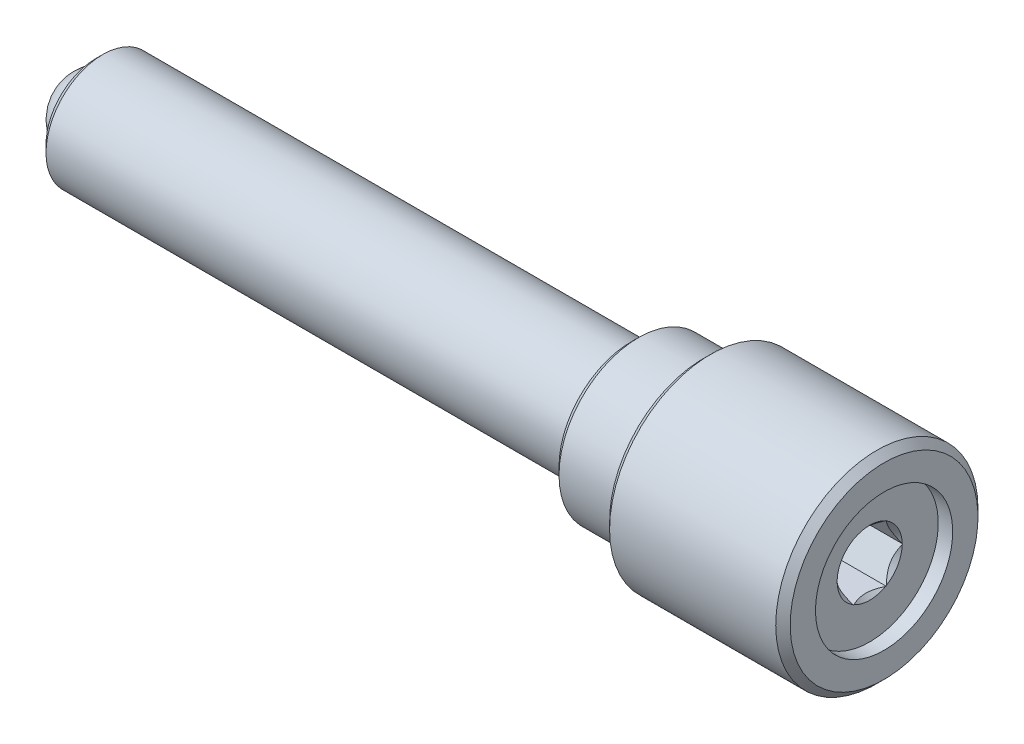
ISO-10303-21;
HEADER;
FILE_DESCRIPTION(('STEP AP214'),'2;1');
FILE_NAME('part.step','',(''),(''),'','','');
FILE_SCHEMA(('AUTOMOTIVE_DESIGN { 1 0 10303 214 1 1 1 1 }'));
ENDSEC;
DATA;
#1=APPLICATION_CONTEXT('core data for automotive mechanical design processes');
#2=APPLICATION_PROTOCOL_DEFINITION('international standard','automotive_design',2000,#1);
#3=PRODUCT_CONTEXT('',#1,'mechanical');
#4=PRODUCT('Part','Part','',(#3));
#5=PRODUCT_RELATED_PRODUCT_CATEGORY('part','',(#4));
#6=PRODUCT_DEFINITION_FORMATION('','',#4);
#7=PRODUCT_DEFINITION_CONTEXT('part definition',#1,'design');
#8=PRODUCT_DEFINITION('design','',#6,#7);
#9=PRODUCT_DEFINITION_SHAPE('','',#8);
#10=(LENGTH_UNIT() NAMED_UNIT(*) SI_UNIT(.MILLI.,.METRE.));
#11=(NAMED_UNIT(*) PLANE_ANGLE_UNIT() SI_UNIT($,.RADIAN.));
#12=(NAMED_UNIT(*) SI_UNIT($,.STERADIAN.) SOLID_ANGLE_UNIT());
#13=UNCERTAINTY_MEASURE_WITH_UNIT(LENGTH_MEASURE(1.E-05),#10,'distance_accuracy_value','');
#14=(GEOMETRIC_REPRESENTATION_CONTEXT(3) GLOBAL_UNCERTAINTY_ASSIGNED_CONTEXT((#13)) GLOBAL_UNIT_ASSIGNED_CONTEXT((#10,
#11,#12)) REPRESENTATION_CONTEXT('',''));
#15=CARTESIAN_POINT('',(0.,0.,0.));
#16=DIRECTION('',(0.,0.,1.));
#17=DIRECTION('',(1.,0.,0.));
#18=AXIS2_PLACEMENT_3D('',#15,#16,#17);
#19=CARTESIAN_POINT('',(-28.6188490285806,-2.28638954609726,11.5802550047874));
#20=DIRECTION('',(1.,0.,0.));
#21=DIRECTION('',(0.,1.,0.));
#22=AXIS2_PLACEMENT_3D('',#19,#20,#21);
#23=PLANE('',#22);
#24=CARTESIAN_POINT('',(-28.6188490285806,-3.68338954609726,11.5802550047874));
#25=DIRECTION('',(1.,0.,0.));
#26=DIRECTION('',(0.,1.,0.));
#27=AXIS2_PLACEMENT_3D('',#24,#25,#26);
#28=CIRCLE('',#27,1.746);
#29=CARTESIAN_POINT('',(-28.6188490285806,-1.93738954609726,11.5802550047874));
#30=VERTEX_POINT('',#29);
#31=EDGE_CURVE('P0_E11',#30,#30,#28,.F.);
#32=ORIENTED_EDGE('',*,*,#31,.T.);
#33=EDGE_LOOP('',(#32));
#34=FACE_BOUND('',#33,.T.);
#35=CARTESIAN_POINT('',(-28.6188490285806,-3.68338954609726,11.5802550047874));
#36=DIRECTION('',(-1.,0.,0.));
#37=DIRECTION('',(0.,-1.,0.));
#38=AXIS2_PLACEMENT_3D('',#35,#36,#37);
#39=CIRCLE('',#38,1.397);
#40=CARTESIAN_POINT('',(-28.6188490285806,-5.08038954609726,11.5802550047874));
#41=VERTEX_POINT('',#40);
#42=EDGE_CURVE('P0_E36',#41,#41,#39,.T.);
#43=ORIENTED_EDGE('',*,*,#42,.F.);
#44=EDGE_LOOP('',(#43));
#45=FACE_BOUND('',#44,.T.);
#46=ADVANCED_FACE('P0_F16',(#34,#45),#23,.F.);
#47=CARTESIAN_POINT('',(-26.4337555020967,-3.68338954609726,11.5802550047874));
#48=DIRECTION('',(-1.,0.,0.));
#49=DIRECTION('',(0.,-1.,0.));
#50=AXIS2_PLACEMENT_3D('',#47,#48,#49);
#51=CYLINDRICAL_SURFACE('',#50,1.397);
#52=CARTESIAN_POINT('',(-27.8307555020967,-3.68338954609726,11.5802550047874));
#53=DIRECTION('',(-1.,0.,0.));
#54=DIRECTION('',(0.,-1.,0.));
#55=AXIS2_PLACEMENT_3D('',#52,#53,#54);
#56=CIRCLE('',#55,1.397);
#57=CARTESIAN_POINT('',(-27.8307555020967,-5.08038954609726,11.5802550047874));
#58=VERTEX_POINT('',#57);
#59=EDGE_CURVE('P0_E34',#58,#58,#56,.T.);
#60=ORIENTED_EDGE('',*,*,#59,.F.);
#61=EDGE_LOOP('',(#60));
#62=FACE_BOUND('',#61,.T.);
#63=ORIENTED_EDGE('',*,*,#42,.T.);
#64=EDGE_LOOP('',(#63));
#65=FACE_BOUND('',#64,.T.);
#66=ADVANCED_FACE('P0_F30',(#62,#65),#51,.F.);
#67=CARTESIAN_POINT('',(-27.8307555020967,-3.68338954609726,11.5802550047874));
#68=DIRECTION('',(-1.,0.,0.));
#69=DIRECTION('',(0.,-1.,0.));
#70=AXIS2_PLACEMENT_3D('',#67,#68,#69);
#71=CONICAL_SURFACE('',#70,1.397,0.785398163397451);
#72=CARTESIAN_POINT('',(-26.4337555020967,-3.68338954609726,11.5802550047874));
#73=VERTEX_POINT('',#72);
#74=VERTEX_LOOP('',#73);
#75=FACE_BOUND('',#74,.T.);
#76=ORIENTED_EDGE('',*,*,#59,.T.);
#77=EDGE_LOOP('',(#76));
#78=FACE_BOUND('',#77,.T.);
#79=ADVANCED_FACE('P0_F26',(#75,#78),#71,.F.);
#80=CARTESIAN_POINT('',(-5.78724902858061,-3.68338954609726,11.5802550047874));
#81=DIRECTION('',(-1.,0.,0.));
#82=DIRECTION('',(0.,-1.,0.));
#83=AXIS2_PLACEMENT_3D('',#80,#81,#82);
#84=PLANE('',#83);
#85=CARTESIAN_POINT('',(-5.78724902858061,-3.68338954609726,11.5802550047874));
#86=DIRECTION('',(-1.,0.,0.));
#87=DIRECTION('',(0.,-1.,0.));
#88=AXIS2_PLACEMENT_3D('',#85,#86,#87);
#89=CIRCLE('',#88,1.74599999999999);
#90=CARTESIAN_POINT('',(-5.78724902858061,-5.42938954609725,11.5802550047874));
#91=VERTEX_POINT('',#90);
#92=EDGE_CURVE('P0_E23',#91,#91,#89,.F.);
#93=ORIENTED_EDGE('',*,*,#92,.T.);
#94=EDGE_LOOP('',(#93));
#95=FACE_BOUND('',#94,.T.);
#96=ADVANCED_FACE('P0_F29',(#95),#84,.F.);
#97=CARTESIAN_POINT('',(-26.4337555020967,-3.68338954609726,11.5802550047874));
#98=DIRECTION('',(-1.,0.,0.));
#99=DIRECTION('',(0.,-1.,0.));
#100=AXIS2_PLACEMENT_3D('',#97,#98,#99);
#101=CYLINDRICAL_SURFACE('',#100,2.);
#102=CARTESIAN_POINT('',(-6.04124902858061,-3.68338954609726,11.5802550047874));
#103=DIRECTION('',(-1.,0.,0.));
#104=DIRECTION('',(0.,0.,1.));
#105=AXIS2_PLACEMENT_3D('',#102,#103,#104);
#106=CIRCLE('',#105,2.);
#107=CARTESIAN_POINT('',(-6.04124902858061,-3.68338954609726,13.5802550047874));
#108=VERTEX_POINT('',#107);
#109=EDGE_CURVE('P0_E44',#108,#108,#106,.T.);
#110=ORIENTED_EDGE('',*,*,#109,.T.);
#111=EDGE_LOOP('',(#110));
#112=FACE_BOUND('',#111,.T.);
#113=CARTESIAN_POINT('',(-28.3648490285806,-3.68338954609726,11.5802550047874));
#114=DIRECTION('',(1.,0.,0.));
#115=DIRECTION('',(0.,1.,0.));
#116=AXIS2_PLACEMENT_3D('',#113,#114,#115);
#117=CIRCLE('',#116,2.);
#118=CARTESIAN_POINT('',(-28.3648490285806,-1.68338954609726,11.5802550047874));
#119=VERTEX_POINT('',#118);
#120=EDGE_CURVE('P0_E39',#119,#119,#117,.T.);
#121=ORIENTED_EDGE('',*,*,#120,.T.);
#122=EDGE_LOOP('',(#121));
#123=FACE_BOUND('',#122,.T.);
#124=ADVANCED_FACE('P0_F53',(#112,#123),#101,.T.);
#125=CARTESIAN_POINT('',(-6.04124902858061,-3.68338954609726,11.5802550047874));
#126=DIRECTION('',(-1.,0.,0.));
#127=DIRECTION('',(0.,0.,1.));
#128=AXIS2_PLACEMENT_3D('',#125,#126,#127);
#129=CONICAL_SURFACE('',#128,2.,0.785398163397453);
#130=ORIENTED_EDGE('',*,*,#92,.F.);
#131=EDGE_LOOP('',(#130));
#132=FACE_BOUND('',#131,.T.);
#133=ORIENTED_EDGE('',*,*,#109,.F.);
#134=EDGE_LOOP('',(#133));
#135=FACE_BOUND('',#134,.T.);
#136=ADVANCED_FACE('P0_F50',(#132,#135),#129,.T.);
#137=CARTESIAN_POINT('',(-28.6188490285806,-3.68338954609726,11.5802550047874));
#138=DIRECTION('',(1.,0.,0.));
#139=DIRECTION('',(0.,1.,0.));
#140=AXIS2_PLACEMENT_3D('',#137,#138,#139);
#141=CONICAL_SURFACE('',#140,1.746,0.785398163397443);
#142=ORIENTED_EDGE('',*,*,#120,.F.);
#143=EDGE_LOOP('',(#142));
#144=FACE_BOUND('',#143,.T.);
#145=ORIENTED_EDGE('',*,*,#31,.F.);
#146=EDGE_LOOP('',(#145));
#147=FACE_BOUND('',#146,.T.);
#148=ADVANCED_FACE('P0_F18',(#144,#147),#141,.T.);
#149=CLOSED_SHELL('',(#46,#66,#79,#96,#124,#136,#148));
#150=MANIFOLD_SOLID_BREP('P0_B1',#149);
#151=CARTESIAN_POINT('',(-28.3981865285806,-3.68338954609726,11.5802550047874));
#152=DIRECTION('',(0.,1.,0.));
#153=DIRECTION('',(-1.,0.,0.));
#154=AXIS2_PLACEMENT_3D('',#151,#152,#153);
#155=SPHERICAL_SURFACE('',#154,1.3890625);
#156=CARTESIAN_POINT('',(-28.3981865285806,-3.68338954609726,11.5802550047874));
#157=DIRECTION('',(0.,-1.,0.));
#158=DIRECTION('',(0.,0.,-1.));
#159=AXIS2_PLACEMENT_3D('',#156,#157,#158);
#160=CIRCLE('',#159,1.3890625);
#161=CARTESIAN_POINT('',(-29.7872490285806,-3.68338954609726,11.5802550047874));
#162=VERTEX_POINT('',#161);
#163=CARTESIAN_POINT('',(-27.0091240285806,-3.68338954609726,11.5802550047874));
#164=VERTEX_POINT('',#163);
#165=EDGE_CURVE('P1_E38',#162,#164,#160,.T.);
#166=ORIENTED_EDGE('',*,*,#165,.T.);
#167=CARTESIAN_POINT('',(-28.3981865285806,-3.68338954609726,11.5802550047874));
#168=DIRECTION('',(0.,0.,-1.));
#169=DIRECTION('',(-1.,0.,0.));
#170=AXIS2_PLACEMENT_3D('',#167,#168,#169);
#171=CIRCLE('',#170,1.3890625);
#172=EDGE_CURVE('P1_E11',#164,#162,#171,.T.);
#173=ORIENTED_EDGE('',*,*,#172,.T.);
#174=EDGE_LOOP('',(#166,#173));
#175=FACE_BOUND('',#174,.T.);
#176=ADVANCED_FACE('P1_F16',(#175),#155,.T.);
#177=ORIENTED_EDGE('',*,*,#165,.F.);
#178=CARTESIAN_POINT('',(-28.3981865285806,-3.68338954609726,11.5802550047874));
#179=DIRECTION('',(0.,0.,-1.));
#180=DIRECTION('',(-1.,0.,0.));
#181=AXIS2_PLACEMENT_3D('',#178,#179,#180);
#182=CIRCLE('',#181,1.3890625);
#183=EDGE_CURVE('P1_E23',#162,#164,#182,.T.);
#184=ORIENTED_EDGE('',*,*,#183,.T.);
#185=EDGE_LOOP('',(#177,#184));
#186=FACE_BOUND('',#185,.T.);
#187=ADVANCED_FACE('P1_F37',(#186),#155,.T.);
#188=ORIENTED_EDGE('',*,*,#172,.F.);
#189=EDGE_CURVE('P1_E34',#164,#162,#160,.T.);
#190=ORIENTED_EDGE('',*,*,#189,.T.);
#191=EDGE_LOOP('',(#188,#190));
#192=FACE_BOUND('',#191,.T.);
#193=ADVANCED_FACE('P1_F32',(#192),#155,.T.);
#194=ORIENTED_EDGE('',*,*,#183,.F.);
#195=ORIENTED_EDGE('',*,*,#189,.F.);
#196=EDGE_LOOP('',(#194,#195));
#197=FACE_BOUND('',#196,.T.);
#198=ADVANCED_FACE('P1_F18',(#197),#155,.T.);
#199=CLOSED_SHELL('',(#176,#187,#193,#198));
#200=MANIFOLD_SOLID_BREP('P1_B1',#199);
#201=CARTESIAN_POINT('',(-7.2472490285806,-3.68338954609726,11.5802550047874));
#202=DIRECTION('',(-1.,0.,0.));
#203=DIRECTION('',(0.,0.865967665550997,0.500099992221712));
#204=AXIS2_PLACEMENT_3D('',#201,#202,#203);
#205=CYLINDRICAL_SURFACE('',#204,2.794);
#206=CARTESIAN_POINT('',(-9.5332490285806,-3.68338954609726,11.5802550047874));
#207=DIRECTION('',(1.,0.,0.));
#208=DIRECTION('',(0.,-0.865967665550997,-0.500099992221712));
#209=AXIS2_PLACEMENT_3D('',#206,#207,#208);
#210=CIRCLE('',#209,2.794);
#211=CARTESIAN_POINT('',(-9.5332490285806,-6.10290320364675,10.18297562652));
#212=VERTEX_POINT('',#211);
#213=EDGE_CURVE('P2_E29',#212,#212,#210,.T.);
#214=ORIENTED_EDGE('',*,*,#213,.T.);
#215=EDGE_LOOP('',(#214));
#216=FACE_BOUND('',#215,.T.);
#217=CARTESIAN_POINT('',(-7.2472490285806,-3.68338954609726,11.5802550047874));
#218=DIRECTION('',(1.,0.,0.));
#219=DIRECTION('',(0.,-0.865967665550997,-0.500099992221712));
#220=AXIS2_PLACEMENT_3D('',#217,#218,#219);
#221=CIRCLE('',#220,2.794);
#222=CARTESIAN_POINT('',(-7.2472490285806,-6.10290320364675,10.18297562652));
#223=VERTEX_POINT('',#222);
#224=EDGE_CURVE('P2_E168',#223,#223,#221,.T.);
#225=ORIENTED_EDGE('',*,*,#224,.F.);
#226=EDGE_LOOP('',(#225));
#227=FACE_BOUND('',#226,.T.);
#228=ADVANCED_FACE('P2_F15',(#216,#227),#205,.T.);
#229=CARTESIAN_POINT('',(-9.7872490285806,-3.68338954609726,11.5802550047874));
#230=DIRECTION('',(1.,0.,0.));
#231=DIRECTION('',(0.,-0.865967665550997,-0.500099992221712));
#232=AXIS2_PLACEMENT_3D('',#229,#230,#231);
#233=PLANE('',#232);
#234=CARTESIAN_POINT('',(-9.7872490285806,-3.68338954609726,11.5802550047874));
#235=DIRECTION('',(1.,0.,0.));
#236=DIRECTION('',(0.,-0.865967665550997,-0.500099992221712));
#237=AXIS2_PLACEMENT_3D('',#234,#235,#236);
#238=CIRCLE('',#237,2.2479);
#239=CARTESIAN_POINT('',(-9.7872490285806,-5.62999826148935,10.4560802322722));
#240=VERTEX_POINT('',#239);
#241=EDGE_CURVE('P2_E191',#240,#240,#238,.T.);
#242=ORIENTED_EDGE('',*,*,#241,.T.);
#243=EDGE_LOOP('',(#242));
#244=FACE_BOUND('',#243,.T.);
#245=CARTESIAN_POINT('',(-9.7872490285806,-3.68338954609726,11.5802550047874));
#246=DIRECTION('',(1.,0.,0.));
#247=DIRECTION('',(0.,-0.865967665550997,-0.500099992221712));
#248=AXIS2_PLACEMENT_3D('',#245,#246,#247);
#249=CIRCLE('',#248,2.54);
#250=CARTESIAN_POINT('',(-9.7872490285806,-5.8829474165968,10.3100010245443));
#251=VERTEX_POINT('',#250);
#252=EDGE_CURVE('P2_E188',#251,#251,#249,.F.);
#253=ORIENTED_EDGE('',*,*,#252,.T.);
#254=EDGE_LOOP('',(#253));
#255=FACE_BOUND('',#254,.T.);
#256=ADVANCED_FACE('P2_F214',(#244,#255),#233,.F.);
#257=CARTESIAN_POINT('',(-7.2472490285806,-3.68338954609726,11.5802550047874));
#258=DIRECTION('',(1.,0.,0.));
#259=DIRECTION('',(0.,-0.865967665550997,-0.500099992221712));
#260=AXIS2_PLACEMENT_3D('',#257,#258,#259);
#261=PLANE('',#260);
#262=CARTESIAN_POINT('',(-7.2472490285806,-3.68338954609726,11.5802550047874));
#263=DIRECTION('',(1.,0.,0.));
#264=DIRECTION('',(0.,-0.865967665550997,-0.500099992221712));
#265=AXIS2_PLACEMENT_3D('',#262,#263,#264);
#266=CIRCLE('',#265,3.302);
#267=CARTESIAN_POINT('',(-7.2472490285806,-6.54281477774666,9.92892483047133));
#268=VERTEX_POINT('',#267);
#269=EDGE_CURVE('P2_E182',#268,#268,#266,.F.);
#270=ORIENTED_EDGE('',*,*,#269,.T.);
#271=EDGE_LOOP('',(#270));
#272=FACE_BOUND('',#271,.T.);
#273=ORIENTED_EDGE('',*,*,#224,.T.);
#274=EDGE_LOOP('',(#273));
#275=FACE_BOUND('',#274,.T.);
#276=ADVANCED_FACE('P2_F219',(#272,#275),#261,.F.);
#277=CARTESIAN_POINT('',(-0.897249028580602,-3.68338954609726,11.5802550047874));
#278=DIRECTION('',(-1.,0.,0.));
#279=DIRECTION('',(0.,0.865967665550997,0.500099992221712));
#280=AXIS2_PLACEMENT_3D('',#277,#278,#279);
#281=CYLINDRICAL_SURFACE('',#280,3.556);
#282=CARTESIAN_POINT('',(-1.1512490285806,-3.68338954609726,11.5802550047874));
#283=DIRECTION('',(1.,0.,0.));
#284=DIRECTION('',(0.,-0.865967665550997,-0.500099992221712));
#285=AXIS2_PLACEMENT_3D('',#282,#283,#284);
#286=CIRCLE('',#285,3.556);
#287=CARTESIAN_POINT('',(-1.1512490285806,-6.76277056479661,9.80189943244702));
#288=VERTEX_POINT('',#287);
#289=EDGE_CURVE('P2_E179',#288,#288,#286,.F.);
#290=ORIENTED_EDGE('',*,*,#289,.T.);
#291=EDGE_LOOP('',(#290));
#292=FACE_BOUND('',#291,.T.);
#293=CARTESIAN_POINT('',(-6.99324902858061,-3.68338954609726,11.5802550047874));
#294=DIRECTION('',(1.,0.,0.));
#295=DIRECTION('',(0.,-0.865967665550997,-0.500099992221712));
#296=AXIS2_PLACEMENT_3D('',#293,#294,#295);
#297=CIRCLE('',#296,3.556);
#298=CARTESIAN_POINT('',(-6.99324902858061,-6.76277056479661,9.80189943244702));
#299=VERTEX_POINT('',#298);
#300=EDGE_CURVE('P2_E176',#299,#299,#297,.T.);
#301=ORIENTED_EDGE('',*,*,#300,.T.);
#302=EDGE_LOOP('',(#301));
#303=FACE_BOUND('',#302,.T.);
#304=ADVANCED_FACE('P2_F237',(#292,#303),#281,.T.);
#305=CARTESIAN_POINT('',(-0.897249028580602,-3.68338954609726,11.5802550047874));
#306=DIRECTION('',(1.,0.,0.));
#307=DIRECTION('',(0.,-0.865967665550997,-0.500099992221712));
#308=AXIS2_PLACEMENT_3D('',#305,#306,#307);
#309=PLANE('',#308);
#310=CARTESIAN_POINT('',(-0.897249028580602,-3.68338954609726,11.5802550047874));
#311=DIRECTION('',(1.,0.,0.));
#312=DIRECTION('',(0.,-0.865967665550997,-0.500099992221712));
#313=AXIS2_PLACEMENT_3D('',#310,#311,#312);
#314=CIRCLE('',#313,3.302);
#315=CARTESIAN_POINT('',(-0.897249028580602,-6.54281477774665,9.92892483047133));
#316=VERTEX_POINT('',#315);
#317=EDGE_CURVE('P2_E173',#316,#316,#314,.T.);
#318=ORIENTED_EDGE('',*,*,#317,.T.);
#319=EDGE_LOOP('',(#318));
#320=FACE_BOUND('',#319,.T.);
#321=CARTESIAN_POINT('',(-0.897249028580602,-3.68338954609726,11.5802550047874));
#322=DIRECTION('',(1.,0.,0.));
#323=DIRECTION('',(0.,-0.865967665550997,-0.500099992221712));
#324=AXIS2_PLACEMENT_3D('',#321,#322,#323);
#325=CIRCLE('',#324,2.413);
#326=CARTESIAN_POINT('',(-0.897249028580602,-5.77296952307182,10.3735137235564));
#327=VERTEX_POINT('',#326);
#328=EDGE_CURVE('P2_E164',#327,#327,#325,.T.);
#329=ORIENTED_EDGE('',*,*,#328,.F.);
#330=EDGE_LOOP('',(#329));
#331=FACE_BOUND('',#330,.T.);
#332=ADVANCED_FACE('P2_F239',(#320,#331),#309,.T.);
#333=CARTESIAN_POINT('',(-1.4052490285806,-3.68338954609726,11.5802550047874));
#334=DIRECTION('',(1.,0.,0.));
#335=DIRECTION('',(0.,-0.865967665550997,-0.500099992221712));
#336=AXIS2_PLACEMENT_3D('',#333,#334,#335);
#337=CYLINDRICAL_SURFACE('',#336,2.413);
#338=CARTESIAN_POINT('',(-1.4052490285806,-3.68338954609726,11.5802550047874));
#339=DIRECTION('',(1.,0.,0.));
#340=DIRECTION('',(0.,-0.865967665550997,-0.500099992221712));
#341=AXIS2_PLACEMENT_3D('',#338,#339,#340);
#342=CIRCLE('',#341,2.413);
#343=CARTESIAN_POINT('',(-1.4052490285806,-5.77296952307182,10.3735137235564));
#344=VERTEX_POINT('',#343);
#345=EDGE_CURVE('P2_E165',#344,#344,#342,.T.);
#346=ORIENTED_EDGE('',*,*,#345,.F.);
#347=EDGE_LOOP('',(#346));
#348=FACE_BOUND('',#347,.T.);
#349=ORIENTED_EDGE('',*,*,#328,.T.);
#350=EDGE_LOOP('',(#349));
#351=FACE_BOUND('',#350,.T.);
#352=ADVANCED_FACE('P2_F245',(#348,#351),#337,.F.);
#353=CARTESIAN_POINT('',(-1.4052490285806,-3.68338954609726,11.5802550047874));
#354=DIRECTION('',(1.,0.,0.));
#355=DIRECTION('',(0.,-0.865967665550997,-0.500099992221712));
#356=AXIS2_PLACEMENT_3D('',#353,#354,#355);
#357=PLANE('',#356);
#358=CARTESIAN_POINT('',(-1.4052490285806,-3.68338954609726,11.5802550047874));
#359=DIRECTION('',(1.,0.,0.));
#360=DIRECTION('',(0.,-0.865967665550997,-0.500099992221712));
#361=AXIS2_PLACEMENT_3D('',#358,#359,#360);
#362=CIRCLE('',#361,1.143);
#363=CARTESIAN_POINT('',(-1.4052490285806,-4.66273442568325,10.9909056967971));
#364=VERTEX_POINT('',#363);
#365=CARTESIAN_POINT('',(-1.4052490285806,-3.70384466873571,10.437438051834));
#366=VERTEX_POINT('',#365);
#367=EDGE_CURVE('P2_E112',#364,#366,#362,.T.);
#368=ORIENTED_EDGE('',*,*,#367,.F.);
#369=DIRECTION('',(0.,0.866083130471901,-0.499900001112214));
#370=VECTOR('',#369,1.);
#371=CARTESIAN_POINT('',(-1.4052490285806,-4.68332287572803,11.0027892745256));
#372=LINE('',#371,#370);
#373=CARTESIAN_POINT('',(-1.4052490285806,-4.68332287572803,11.0027892745256));
#374=VERTEX_POINT('',#373);
#375=EDGE_CURVE('P2_E124',#374,#364,#372,.T.);
#376=ORIENTED_EDGE('',*,*,#375,.F.);
#377=DIRECTION('',(0.,0.000115464920903918,-0.999999993333926));
#378=VECTOR('',#377,1.);
#379=CARTESIAN_POINT('',(-1.4052490285806,-4.68345620313436,12.1574898052075));
#380=LINE('',#379,#378);
#381=CARTESIAN_POINT('',(-1.4052490285806,-4.68332562054971,11.0265611841531));
#382=VERTEX_POINT('',#381);
#383=EDGE_CURVE('P2_E332',#382,#374,#380,.T.);
#384=ORIENTED_EDGE('',*,*,#383,.F.);
#385=CARTESIAN_POINT('',(-1.4052490285806,-4.68345345831268,12.1337178955799));
#386=VERTEX_POINT('',#385);
#387=EDGE_CURVE('P2_E129',#386,#382,#362,.T.);
#388=ORIENTED_EDGE('',*,*,#387,.F.);
#389=CARTESIAN_POINT('',(-1.4052490285806,-4.68345620313436,12.1574898052075));
#390=VERTEX_POINT('',#389);
#391=EDGE_CURVE('P2_E138',#390,#386,#380,.T.);
#392=ORIENTED_EDGE('',*,*,#391,.F.);
#393=DIRECTION('',(0.,-0.865967665550997,-0.500099992221712));
#394=VECTOR('',#393,1.);
#395=CARTESIAN_POINT('',(-1.4052490285806,-3.68352287350359,12.7349555354694));
#396=LINE('',#395,#394);
#397=CARTESIAN_POINT('',(-1.4052490285806,-4.66287049791127,12.1693781371066));
#398=VERTEX_POINT('',#397);
#399=EDGE_CURVE('P2_E333',#398,#390,#396,.T.);
#400=ORIENTED_EDGE('',*,*,#399,.F.);
#401=CARTESIAN_POINT('',(-1.4052490285806,-3.70410857872669,12.7230672035703));
#402=VERTEX_POINT('',#401);
#403=EDGE_CURVE('P2_E369',#402,#398,#362,.T.);
#404=ORIENTED_EDGE('',*,*,#403,.F.);
#405=CARTESIAN_POINT('',(-1.4052490285806,-3.68352287350359,12.7349555354694));
#406=VERTEX_POINT('',#405);
#407=EDGE_CURVE('P2_E327',#406,#402,#396,.T.);
#408=ORIENTED_EDGE('',*,*,#407,.F.);
#409=DIRECTION('',(0.,-0.866083130471901,0.499900001112214));
#410=VECTOR('',#409,1.);
#411=CARTESIAN_POINT('',(-1.4052490285806,-2.68345621646649,12.1577207350493));
#412=LINE('',#411,#410);
#413=CARTESIAN_POINT('',(-1.4052490285806,-3.66293442345881,12.7230719577409));
#414=VERTEX_POINT('',#413);
#415=EDGE_CURVE('P2_E338',#414,#406,#412,.T.);
#416=ORIENTED_EDGE('',*,*,#415,.F.);
#417=CARTESIAN_POINT('',(-1.4052490285806,-2.70404466651127,12.1696043127778));
#418=VERTEX_POINT('',#417);
#419=EDGE_CURVE('P2_E368',#418,#414,#362,.T.);
#420=ORIENTED_EDGE('',*,*,#419,.F.);
#421=CARTESIAN_POINT('',(-1.4052490285806,-2.68345621646649,12.1577207350493));
#422=VERTEX_POINT('',#421);
#423=EDGE_CURVE('P2_E334',#422,#418,#412,.T.);
#424=ORIENTED_EDGE('',*,*,#423,.F.);
#425=DIRECTION('',(0.,-0.000115464920903863,0.999999993333926));
#426=VECTOR('',#425,1.);
#427=CARTESIAN_POINT('',(-1.4052490285806,-2.68332288906016,11.0030202043674));
#428=LINE('',#427,#426);
#429=CARTESIAN_POINT('',(-1.4052490285806,-2.68345347164481,12.1339488254217));
#430=VERTEX_POINT('',#429);
#431=EDGE_CURVE('P2_E274',#430,#422,#428,.T.);
#432=ORIENTED_EDGE('',*,*,#431,.F.);
#433=CARTESIAN_POINT('',(-1.4052490285806,-2.68332563388184,11.0267921139949));
#434=VERTEX_POINT('',#433);
#435=EDGE_CURVE('P2_E35',#434,#430,#362,.T.);
#436=ORIENTED_EDGE('',*,*,#435,.F.);
#437=CARTESIAN_POINT('',(-1.4052490285806,-2.68332288906016,11.0030202043674));
#438=VERTEX_POINT('',#437);
#439=EDGE_CURVE('P2_E339',#438,#434,#428,.T.);
#440=ORIENTED_EDGE('',*,*,#439,.F.);
#441=DIRECTION('',(0.,0.865967665550997,0.500099992221712));
#442=VECTOR('',#441,1.);
#443=CARTESIAN_POINT('',(-1.4052490285806,-3.68325621869093,10.4255544741055));
#444=LINE('',#443,#442);
#445=CARTESIAN_POINT('',(-1.4052490285806,-2.70390859428326,10.9911318724683));
#446=VERTEX_POINT('',#445);
#447=EDGE_CURVE('P2_E134',#446,#438,#444,.T.);
#448=ORIENTED_EDGE('',*,*,#447,.F.);
#449=CARTESIAN_POINT('',(-1.4052490285806,-3.66267051346783,10.4374428060046));
#450=VERTEX_POINT('',#449);
#451=EDGE_CURVE('P2_E42',#450,#446,#362,.T.);
#452=ORIENTED_EDGE('',*,*,#451,.F.);
#453=CARTESIAN_POINT('',(-1.4052490285806,-3.68325621869093,10.4255544741055));
#454=VERTEX_POINT('',#453);
#455=EDGE_CURVE('P2_E136',#454,#450,#444,.T.);
#456=ORIENTED_EDGE('',*,*,#455,.F.);
#457=EDGE_CURVE('P2_E126',#366,#454,#372,.T.);
#458=ORIENTED_EDGE('',*,*,#457,.F.);
#459=EDGE_LOOP('',(#368,#376,#384,#388,#392,#400,#404,#408,#416,#420,#424,#432,#436,#440,#448,
#452,#456,#458));
#460=FACE_BOUND('',#459,.T.);
#461=ORIENTED_EDGE('',*,*,#345,.T.);
#462=EDGE_LOOP('',(#461));
#463=FACE_BOUND('',#462,.T.);
#464=ADVANCED_FACE('P2_F121',(#460,#463),#357,.T.);
#465=CARTESIAN_POINT('',(-4.7072490285806,-3.68338954609726,11.5802550047874));
#466=DIRECTION('',(-1.,0.,0.));
#467=DIRECTION('',(0.,0.865967665550997,0.500099992221712));
#468=AXIS2_PLACEMENT_3D('',#465,#466,#467);
#469=CYLINDRICAL_SURFACE('',#468,1.9939);
#470=CARTESIAN_POINT('',(-9.5332490285806,-3.68338954609726,11.5802550047874));
#471=DIRECTION('',(1.,0.,0.));
#472=DIRECTION('',(0.,-0.865967665550997,-0.500099992221712));
#473=AXIS2_PLACEMENT_3D('',#470,#471,#472);
#474=CIRCLE('',#473,1.9939);
#475=CARTESIAN_POINT('',(-9.5332490285806,-5.4100424744394,10.5831056302966));
#476=VERTEX_POINT('',#475);
#477=EDGE_CURVE('P2_E185',#476,#476,#474,.F.);
#478=ORIENTED_EDGE('',*,*,#477,.T.);
#479=EDGE_LOOP('',(#478));
#480=FACE_BOUND('',#479,.T.);
#481=CARTESIAN_POINT('',(-4.7072490285806,-3.68338954609726,11.5802550047874));
#482=DIRECTION('',(-1.,0.,0.));
#483=DIRECTION('',(0.,0.865967665550997,0.500099992221712));
#484=AXIS2_PLACEMENT_3D('',#481,#482,#483);
#485=CIRCLE('',#484,1.9939);
#486=CARTESIAN_POINT('',(-4.7072490285806,-1.95673661775513,12.5774043792783));
#487=VERTEX_POINT('',#486);
#488=EDGE_CURVE('P2_E147',#487,#487,#485,.T.);
#489=ORIENTED_EDGE('',*,*,#488,.F.);
#490=EDGE_LOOP('',(#489));
#491=FACE_BOUND('',#490,.T.);
#492=ADVANCED_FACE('P2_F256',(#480,#491),#469,.F.);
#493=CARTESIAN_POINT('',(-4.7072490285806,-3.68338954609726,11.5802550047874));
#494=DIRECTION('',(-1.,0.,0.));
#495=DIRECTION('',(0.,0.865967665550997,0.500099992221712));
#496=AXIS2_PLACEMENT_3D('',#493,#494,#495);
#497=PLANE('',#496);
#498=ORIENTED_EDGE('',*,*,#488,.T.);
#499=EDGE_LOOP('',(#498));
#500=FACE_BOUND('',#499,.T.);
#501=ADVANCED_FACE('P2_F227',(#500),#497,.T.);
#502=CARTESIAN_POINT('',(-0.897249028580602,-3.68338954609726,11.5802550047874));
#503=DIRECTION('',(-1.,0.,0.));
#504=DIRECTION('',(0.,0.865967665550997,0.500099992221712));
#505=AXIS2_PLACEMENT_3D('',#502,#503,#504);
#506=CONICAL_SURFACE('',#505,3.302,0.785398163397449);
#507=ORIENTED_EDGE('',*,*,#289,.F.);
#508=EDGE_LOOP('',(#507));
#509=FACE_BOUND('',#508,.T.);
#510=ORIENTED_EDGE('',*,*,#317,.F.);
#511=EDGE_LOOP('',(#510));
#512=FACE_BOUND('',#511,.T.);
#513=ADVANCED_FACE('P2_F224',(#509,#512),#506,.T.);
#514=CARTESIAN_POINT('',(-6.99324902858061,-3.68338954609726,11.5802550047874));
#515=DIRECTION('',(1.,0.,0.));
#516=DIRECTION('',(0.,-0.865967665550997,-0.500099992221712));
#517=AXIS2_PLACEMENT_3D('',#514,#515,#516);
#518=CONICAL_SURFACE('',#517,3.556,0.785398163397451);
#519=ORIENTED_EDGE('',*,*,#269,.F.);
#520=EDGE_LOOP('',(#519));
#521=FACE_BOUND('',#520,.T.);
#522=ORIENTED_EDGE('',*,*,#300,.F.);
#523=EDGE_LOOP('',(#522));
#524=FACE_BOUND('',#523,.T.);
#525=ADVANCED_FACE('P2_F210',(#521,#524),#518,.T.);
#526=CARTESIAN_POINT('',(-9.5332490285806,-3.68338954609726,11.5802550047874));
#527=DIRECTION('',(-1.,0.,0.));
#528=DIRECTION('',(0.,0.865967665550997,0.500099992221712));
#529=AXIS2_PLACEMENT_3D('',#526,#527,#528);
#530=CONICAL_SURFACE('',#529,1.9939,0.785398163397448);
#531=ORIENTED_EDGE('',*,*,#241,.F.);
#532=EDGE_LOOP('',(#531));
#533=FACE_BOUND('',#532,.T.);
#534=ORIENTED_EDGE('',*,*,#477,.F.);
#535=EDGE_LOOP('',(#534));
#536=FACE_BOUND('',#535,.T.);
#537=ADVANCED_FACE('P2_F200',(#533,#536),#530,.F.);
#538=CARTESIAN_POINT('',(-9.5332490285806,-3.68338954609726,11.5802550047874));
#539=DIRECTION('',(1.,0.,0.));
#540=DIRECTION('',(0.,-0.865967665550997,-0.500099992221712));
#541=AXIS2_PLACEMENT_3D('',#538,#539,#540);
#542=CONICAL_SURFACE('',#541,2.794,0.785398163397449);
#543=ORIENTED_EDGE('',*,*,#252,.F.);
#544=EDGE_LOOP('',(#543));
#545=FACE_BOUND('',#544,.T.);
#546=ORIENTED_EDGE('',*,*,#213,.F.);
#547=EDGE_LOOP('',(#546));
#548=FACE_BOUND('',#547,.T.);
#549=ADVANCED_FACE('P2_F17',(#545,#548),#542,.T.);
#550=CARTESIAN_POINT('',(-3.9452490285806,-2.68332288906016,11.0030202043674));
#551=DIRECTION('',(0.,0.999999993333926,0.000115464920903807));
#552=DIRECTION('',(0.,-0.000115464920903807,0.999999993333926));
#553=AXIS2_PLACEMENT_3D('',#550,#551,#552);
#554=PLANE('',#553);
#555=ORIENTED_EDGE('',*,*,#439,.T.);
#556=CARTESIAN_POINT('',(-1.40504902858056,-2.68332558621425,11.0263792821355));
#557=CARTESIAN_POINT('',(-1.42361017298776,-2.68333001199373,11.0647093603639));
#558=CARTESIAN_POINT('',(-1.44102745436559,-2.68333451014778,11.1036662486402));
#559=CARTESIAN_POINT('',(-1.47282035047498,-2.68334367334165,11.1830253625621));
#560=CARTESIAN_POINT('',(-1.48717976802387,-2.68334833912427,11.2234340213401));
#561=CARTESIAN_POINT('',(-1.51171498775971,-2.68335774544487,11.3048987680096));
#562=CARTESIAN_POINT('',(-1.52194824873538,-2.68336248392818,11.345937061277));
#563=CARTESIAN_POINT('',(-1.53765007926731,-2.6833720574431,11.428849817598));
#564=CARTESIAN_POINT('',(-1.54312922300843,-2.68337689223583,11.4707222119541));
#565=CARTESIAN_POINT('',(-1.54807624327508,-2.68338535673554,11.5440301879165));
#566=CARTESIAN_POINT('',(-1.54872539631075,-2.68338897750623,11.5753883757014));
#567=CARTESIAN_POINT('',(-1.54707904341957,-2.68339621046025,11.6380303791214));
#568=CARTESIAN_POINT('',(-1.54478279984908,-2.68339982264119,11.6693141741595));
#569=CARTESIAN_POINT('',(-1.53363385714175,-2.68341060443802,11.7626914238698));
#570=CARTESIAN_POINT('',(-1.52052054049672,-2.68341771855042,11.8243041829691));
#571=CARTESIAN_POINT('',(-1.49048981666433,-2.68342964844878,11.9276247256076));
#572=CARTESIAN_POINT('',(-1.47571494885601,-2.6834345424644,11.9700100279219));
#573=CARTESIAN_POINT('',(-1.44271771488499,-2.68344415575901,12.0532673018483));
#574=CARTESIAN_POINT('',(-1.42450701968576,-2.68344887556669,12.0941438522011));
#575=CARTESIAN_POINT('',(-1.4050490285806,-2.68345351931241,12.1343616572811));
#576=B_SPLINE_CURVE_WITH_KNOTS('',3,(#556,#557,#558,#559,#560,#561,#562,#563,#564,#565,#566,
#567,#568,#569,#570,#571,#572,#573,#574,#575),.UNSPECIFIED.,.F.,.F.,(4,2,2,2,2,2,2,2,2,4),(0.,
0.127843602213508,0.256348402717742,0.382996178290248,0.509361534369383,0.603319243404806,
0.697300487756682,0.88528238601917,1.01980211695558,1.15387287456318),.UNSPECIFIED.);
#577=EDGE_CURVE('P2_E267',#434,#430,#576,.T.);
#578=ORIENTED_EDGE('',*,*,#577,.T.);
#579=ORIENTED_EDGE('',*,*,#431,.T.);
#580=DIRECTION('',(1.,0.,0.));
#581=VECTOR('',#580,1.);
#582=CARTESIAN_POINT('',(-3.9452490285806,-2.68345621646649,12.1577207350493));
#583=LINE('',#582,#581);
#584=CARTESIAN_POINT('',(-3.9452490285806,-2.68345621646649,12.1577207350493));
#585=VERTEX_POINT('',#584);
#586=EDGE_CURVE('P2_E158',#585,#422,#583,.T.);
#587=ORIENTED_EDGE('',*,*,#586,.F.);
#588=DIRECTION('',(0.,-0.000115464920903863,0.999999993333926));
#589=VECTOR('',#588,1.);
#590=CARTESIAN_POINT('',(-3.9452490285806,-2.68332288906016,11.0030202043674));
#591=LINE('',#590,#589);
#592=CARTESIAN_POINT('',(-3.9452490285806,-2.68332288906016,11.0030202043674));
#593=VERTEX_POINT('',#592);
#594=EDGE_CURVE('P2_E143',#593,#585,#591,.T.);
#595=ORIENTED_EDGE('',*,*,#594,.F.);
#596=DIRECTION('',(1.,0.,0.));
#597=VECTOR('',#596,1.);
#598=CARTESIAN_POINT('',(-3.9452490285806,-2.68332288906016,11.0030202043674));
#599=LINE('',#598,#597);
#600=EDGE_CURVE('P2_E144',#593,#438,#599,.T.);
#601=ORIENTED_EDGE('',*,*,#600,.T.);
#602=EDGE_LOOP('',(#555,#578,#579,#587,#595,#601));
#603=FACE_BOUND('',#602,.T.);
#604=ADVANCED_FACE('P2_F199',(#603),#554,.F.);
#605=CARTESIAN_POINT('',(-3.9452490285806,-3.68325621869093,10.4255544741055));
#606=DIRECTION('',(0.,0.500099992221712,-0.865967665550997));
#607=DIRECTION('',(0.,0.865967665550997,0.500099992221712));
#608=AXIS2_PLACEMENT_3D('',#605,#606,#607);
#609=PLANE('',#608);
#610=ORIENTED_EDGE('',*,*,#455,.T.);
#611=CARTESIAN_POINT('',(-1.02922919700944,-2.1931202797096,11.2861142861392));
#612=CARTESIAN_POINT('',(-1.05021103928875,-2.21726194992032,11.2721723694085));
#613=CARTESIAN_POINT('',(-1.07098475594222,-2.24153889048715,11.2581523334746));
#614=CARTESIAN_POINT('',(-1.11203021339742,-2.29041793186694,11.2299244801883));
#615=CARTESIAN_POINT('',(-1.1323018265976,-2.31502011294694,11.2157166164814));
#616=CARTESIAN_POINT('',(-1.19252405022281,-2.38975657240699,11.1725559948075));
#617=CARTESIAN_POINT('',(-1.23155879788168,-2.44045364224861,11.1432782223894));
#618=CARTESIAN_POINT('',(-1.30811553811152,-2.54671873615916,11.0819096808697));
#619=CARTESIAN_POINT('',(-1.34542954929494,-2.60240042955032,11.0497532672534));
#620=CARTESIAN_POINT('',(-1.41363359543518,-2.71653600884575,10.9838394871106));
#621=CARTESIAN_POINT('',(-1.44454527481208,-2.77497970588733,10.9500880046955));
#622=CARTESIAN_POINT('',(-1.48236037055621,-2.86277138081417,10.899387940831));
#623=CARTESIAN_POINT('',(-1.49322690105259,-2.8908343114335,10.8831814796168));
#624=CARTESIAN_POINT('',(-1.51235723488436,-2.94763157253305,10.8503808209271));
#625=CARTESIAN_POINT('',(-1.52062085663866,-2.97636594970379,10.8337865964875));
#626=CARTESIAN_POINT('',(-1.53397965150406,-3.03385299700187,10.8005875833484));
#627=CARTESIAN_POINT('',(-1.53912908289731,-3.06259606322285,10.7839883409456));
#628=CARTESIAN_POINT('',(-1.54616355835305,-3.12039131341546,10.7506113393304));
#629=CARTESIAN_POINT('',(-1.54804808666851,-3.14944354549595,10.733833552335));
#630=CARTESIAN_POINT('',(-1.54841289875009,-3.20654201491108,10.7008589445681));
#631=CARTESIAN_POINT('',(-1.54701048409716,-3.23458772753377,10.6846624268199));
#632=CARTESIAN_POINT('',(-1.54113669403383,-3.29042620105284,10.6524154720161));
#633=CARTESIAN_POINT('',(-1.53666601805729,-3.31821901813595,10.6363650025125));
#634=CARTESIAN_POINT('',(-1.52482256923534,-3.37383480079719,10.6042466526217));
#635=CARTESIAN_POINT('',(-1.51740023121105,-3.40164973165671,10.5881834123185));
#636=CARTESIAN_POINT('',(-1.50004555764781,-3.45667270822949,10.556407410453));
#637=CARTESIAN_POINT('',(-1.49011344197262,-3.48388080687591,10.5406946183214));
#638=CARTESIAN_POINT('',(-1.45499945665924,-3.56986430218378,10.4910387858403));
#639=CARTESIAN_POINT('',(-1.42580318458176,-3.62740739986106,10.45780740337));
#640=CARTESIAN_POINT('',(-1.36089974893127,-3.73978736371873,10.3929074985736));
#641=CARTESIAN_POINT('',(-1.32516911793553,-3.79461354003154,10.3612451496911));
#642=CARTESIAN_POINT('',(-1.25146555220597,-3.89938936148226,10.3007366693206));
#643=CARTESIAN_POINT('',(-1.21369275658323,-3.94944590093142,10.2718288059152));
#644=CARTESIAN_POINT('',(-1.15530496973217,-4.02319429780049,10.2292387945698));
#645=CARTESIAN_POINT('',(-1.13563747632401,-4.04745863549318,10.2152260368491));
#646=CARTESIAN_POINT('',(-1.09578365815495,-4.09565599258066,10.1873918591269));
#647=CARTESIAN_POINT('',(-1.07559747666409,-4.11958910071502,10.1735703878781));
#648=CARTESIAN_POINT('',(-1.0551962680673,-4.14338433350602,10.1598285402236));
#649=B_SPLINE_CURVE_WITH_KNOTS('',3,(#611,#612,#613,#614,#615,#616,#617,#618,#619,#620,#621,
#622,#623,#624,#625,#626,#627,#628,#629,#630,#631,#632,#633,#634,#635,#636,#637,#638,#639,#640,
#641,#642,#643,#644,#645,#646,#647,#648),.UNSPECIFIED.,.F.,.F.,(4,2,2,2,2,2,2,2,2,2,2,2,2,2,2,2,
2,2,4),(0.,0.104672600389282,0.209371534234618,0.420367780458932,0.643210412340025,
0.865286917192377,0.967739429213695,1.07019908682585,1.17081790990773,1.27145262599738,
1.36855093112558,1.46562710929396,1.56440734068323,1.66317892163758,1.88028105971958,
2.09817877978305,2.30523049071309,2.40792678539329,2.51059501231904),.UNSPECIFIED.);
#650=EDGE_CURVE('P2_E116',#450,#446,#649,.F.);
#651=ORIENTED_EDGE('',*,*,#650,.T.);
#652=ORIENTED_EDGE('',*,*,#447,.T.);
#653=ORIENTED_EDGE('',*,*,#600,.F.);
#654=DIRECTION('',(0.,0.865967665550997,0.500099992221712));
#655=VECTOR('',#654,1.);
#656=CARTESIAN_POINT('',(-3.9452490285806,-3.68325621869093,10.4255544741055));
#657=LINE('',#656,#655);
#658=CARTESIAN_POINT('',(-3.9452490285806,-3.68325621869093,10.4255544741055));
#659=VERTEX_POINT('',#658);
#660=EDGE_CURVE('P2_E161',#659,#593,#657,.T.);
#661=ORIENTED_EDGE('',*,*,#660,.F.);
#662=DIRECTION('',(1.,0.,0.));
#663=VECTOR('',#662,1.);
#664=CARTESIAN_POINT('',(-3.9452490285806,-3.68325621869093,10.4255544741055));
#665=LINE('',#664,#663);
#666=EDGE_CURVE('P2_E148',#659,#454,#665,.T.);
#667=ORIENTED_EDGE('',*,*,#666,.T.);
#668=EDGE_LOOP('',(#610,#651,#652,#653,#661,#667));
#669=FACE_BOUND('',#668,.T.);
#670=ADVANCED_FACE('P2_F207',(#669),#609,.F.);
#671=CARTESIAN_POINT('',(-3.9452490285806,-4.68332287572803,11.0027892745256));
#672=DIRECTION('',(0.,-0.499900001112214,-0.866083130471901));
#673=DIRECTION('',(0.,0.866083130471901,-0.499900001112214));
#674=AXIS2_PLACEMENT_3D('',#671,#672,#673);
#675=PLANE('',#674);
#676=ORIENTED_EDGE('',*,*,#375,.T.);
#677=CARTESIAN_POINT('',(-1.4050490285806,-4.66309197239473,10.9911120714454));
#678=CARTESIAN_POINT('',(-1.4236101729878,-4.62989493803017,10.9719508651687));
#679=CARTESIAN_POINT('',(-1.44102745436563,-4.59615503405347,10.9524763165462));
#680=CARTESIAN_POINT('',(-1.472820350475,-4.52742344377834,10.9128046951439));
#681=CARTESIAN_POINT('',(-1.48717976802389,-4.49242618585241,10.8926044064412));
#682=CARTESIAN_POINT('',(-1.51171498775973,-4.42187094256349,10.851880179219));
#683=CARTESIAN_POINT('',(-1.52194824873539,-4.38632836882429,10.8313651362323));
#684=CARTESIAN_POINT('',(-1.53765007926731,-4.31451902879512,10.7899170489789));
#685=CARTESIAN_POINT('',(-1.54312922300843,-4.27825405416903,10.7689850388542));
#686=CARTESIAN_POINT('',(-1.54807624327508,-4.21476325243573,10.7323383813447));
#687=CARTESIAN_POINT('',(-1.54872539631075,-4.18760445481205,10.7166624231317));
#688=CARTESIAN_POINT('',(-1.54707904341957,-4.13335127202942,10.6853476853437));
#689=CARTESIAN_POINT('',(-1.54478279984908,-4.10625690470911,10.669708916065));
#690=CARTESIAN_POINT('',(-1.53363385714175,-4.02538444342603,10.6230296285198));
#691=CARTESIAN_POINT('',(-1.52052054049671,-3.97202267179263,10.5922294099723));
#692=CARTESIAN_POINT('',(-1.49048981666432,-3.88253849218569,10.5405794702481));
#693=CARTESIAN_POINT('',(-1.47571494885599,-3.84582929662658,10.5193910574327));
#694=CARTESIAN_POINT('',(-1.44271771488496,-3.77372157570922,10.4777707458269));
#695=CARTESIAN_POINT('',(-1.42450701968573,-3.73831908478074,10.4573365581238));
#696=CARTESIAN_POINT('',(-1.40504902858056,-3.70348712202415,10.4372316771856));
#697=B_SPLINE_CURVE_WITH_KNOTS('',3,(#677,#678,#679,#680,#681,#682,#683,#684,#685,#686,#687,
#688,#689,#690,#691,#692,#693,#694,#695,#696),.UNSPECIFIED.,.F.,.F.,(4,2,2,2,2,2,2,2,2,4),(0.,
0.127843602213489,0.256348402717702,0.382996178290188,0.509361534369304,0.603319243404724,
0.697300487756595,0.885282386019087,1.01980211695554,1.15387287456318),.UNSPECIFIED.);
#698=EDGE_CURVE('P2_E109',#364,#366,#697,.T.);
#699=ORIENTED_EDGE('',*,*,#698,.T.);
#700=ORIENTED_EDGE('',*,*,#457,.T.);
#701=ORIENTED_EDGE('',*,*,#666,.F.);
#702=DIRECTION('',(0.,0.866083130471901,-0.499900001112214));
#703=VECTOR('',#702,1.);
#704=CARTESIAN_POINT('',(-3.9452490285806,-4.68332287572803,11.0027892745256));
#705=LINE('',#704,#703);
#706=CARTESIAN_POINT('',(-3.9452490285806,-4.68332287572803,11.0027892745256));
#707=VERTEX_POINT('',#706);
#708=EDGE_CURVE('P2_E344',#707,#659,#705,.T.);
#709=ORIENTED_EDGE('',*,*,#708,.F.);
#710=DIRECTION('',(1.,0.,0.));
#711=VECTOR('',#710,1.);
#712=CARTESIAN_POINT('',(-3.9452490285806,-4.68332287572803,11.0027892745256));
#713=LINE('',#712,#711);
#714=EDGE_CURVE('P2_E133',#707,#374,#713,.T.);
#715=ORIENTED_EDGE('',*,*,#714,.T.);
#716=EDGE_LOOP('',(#676,#699,#700,#701,#709,#715));
#717=FACE_BOUND('',#716,.T.);
#718=ADVANCED_FACE('P2_F131',(#717),#675,.F.);
#719=CARTESIAN_POINT('',(-3.9452490285806,-4.68345620313436,12.1574898052075));
#720=DIRECTION('',(0.,-0.999999993333926,-0.000115464920903918));
#721=DIRECTION('',(0.,0.000115464920903918,-0.999999993333926));
#722=AXIS2_PLACEMENT_3D('',#719,#720,#721);
#723=PLANE('',#722);
#724=ORIENTED_EDGE('',*,*,#391,.T.);
#725=CARTESIAN_POINT('',(-1.40504902858056,-4.68345350598028,12.1341307274394));
#726=CARTESIAN_POINT('',(-1.42361017298776,-4.6834490802008,12.095800649211));
#727=CARTESIAN_POINT('',(-1.44102745436559,-4.68344458204674,12.0568437609347));
#728=CARTESIAN_POINT('',(-1.47282035047498,-4.68343541885287,11.9774846470127));
#729=CARTESIAN_POINT('',(-1.48717976802387,-4.68343075307025,11.9370759882347));
#730=CARTESIAN_POINT('',(-1.51171498775971,-4.68342134674966,11.8556112415653));
#731=CARTESIAN_POINT('',(-1.52194824873538,-4.68341660826634,11.8145729482978));
#732=CARTESIAN_POINT('',(-1.53765007926731,-4.68340703475143,11.7316601919769));
#733=CARTESIAN_POINT('',(-1.54312922300842,-4.68340219995869,11.6897877976207));
#734=CARTESIAN_POINT('',(-1.54807624327507,-4.68339373545899,11.6164798216583));
#735=CARTESIAN_POINT('',(-1.54872539631074,-4.68339011468829,11.5851216338734));
#736=CARTESIAN_POINT('',(-1.54707904341957,-4.68338288173427,11.5224796304535));
#737=CARTESIAN_POINT('',(-1.54478279984908,-4.68337926955333,11.4911958354153));
#738=CARTESIAN_POINT('',(-1.53363385714175,-4.68336848775651,11.397818585705));
#739=CARTESIAN_POINT('',(-1.52052054049672,-4.6833613736441,11.3362058266058));
#740=CARTESIAN_POINT('',(-1.49048981666433,-4.68334944374574,11.2328852839673));
#741=CARTESIAN_POINT('',(-1.47571494885601,-4.68334454973013,11.1904999816529));
#742=CARTESIAN_POINT('',(-1.44271771488499,-4.68333493643552,11.1072427077266));
#743=CARTESIAN_POINT('',(-1.42450701968576,-4.68333021662783,11.0663661573738));
#744=CARTESIAN_POINT('',(-1.4050490285806,-4.68332557288212,11.0261483522938));
#745=B_SPLINE_CURVE_WITH_KNOTS('',3,(#725,#726,#727,#728,#729,#730,#731,#732,#733,#734,#735,
#736,#737,#738,#739,#740,#741,#742,#743,#744),.UNSPECIFIED.,.F.,.F.,(4,2,2,2,2,2,2,2,2,4),(0.,
0.127843602213508,0.256348402717742,0.382996178290249,0.509361534369385,0.603319243404804,
0.697300487756678,0.885282386019169,1.01980211695558,1.15387287456318),.UNSPECIFIED.);
#746=EDGE_CURVE('P2_E117',#386,#382,#745,.T.);
#747=ORIENTED_EDGE('',*,*,#746,.T.);
#748=ORIENTED_EDGE('',*,*,#383,.T.);
#749=ORIENTED_EDGE('',*,*,#714,.F.);
#750=DIRECTION('',(0.,0.000115464920903918,-0.999999993333926));
#751=VECTOR('',#750,1.);
#752=CARTESIAN_POINT('',(-3.9452490285806,-4.68345620313436,12.1574898052075));
#753=LINE('',#752,#751);
#754=CARTESIAN_POINT('',(-3.9452490285806,-4.68345620313436,12.1574898052075));
#755=VERTEX_POINT('',#754);
#756=EDGE_CURVE('P2_E347',#755,#707,#753,.T.);
#757=ORIENTED_EDGE('',*,*,#756,.F.);
#758=DIRECTION('',(1.,0.,0.));
#759=VECTOR('',#758,1.);
#760=CARTESIAN_POINT('',(-3.9452490285806,-4.68345620313436,12.1574898052075));
#761=LINE('',#760,#759);
#762=EDGE_CURVE('P2_E152',#755,#390,#761,.T.);
#763=ORIENTED_EDGE('',*,*,#762,.T.);
#764=EDGE_LOOP('',(#724,#747,#748,#749,#757,#763));
#765=FACE_BOUND('',#764,.T.);
#766=ADVANCED_FACE('P2_F311',(#765),#723,.F.);
#767=CARTESIAN_POINT('',(-3.9452490285806,-3.68352287350359,12.7349555354694));
#768=DIRECTION('',(0.,-0.500099992221712,0.865967665550997));
#769=DIRECTION('',(0.,-0.865967665550997,-0.500099992221712));
#770=AXIS2_PLACEMENT_3D('',#767,#768,#769);
#771=PLANE('',#770);
#772=ORIENTED_EDGE('',*,*,#407,.T.);
#773=CARTESIAN_POINT('',(-1.02922919700944,-3.19332026415304,13.0180496172412));
#774=CARTESIAN_POINT('',(-1.05021103928875,-3.21746193436375,13.0041077005105));
#775=CARTESIAN_POINT('',(-1.07098475594222,-3.24173887493058,12.9900876645766));
#776=CARTESIAN_POINT('',(-1.11203021339742,-3.29061791631038,12.9618598112903));
#777=CARTESIAN_POINT('',(-1.1323018265976,-3.31522009739038,12.9476519475834));
#778=CARTESIAN_POINT('',(-1.19252405022281,-3.38995655685042,12.9044913259095));
#779=CARTESIAN_POINT('',(-1.23155879788168,-3.44065362669204,12.8752135534914));
#780=CARTESIAN_POINT('',(-1.30811553811152,-3.54691872060259,12.8138450119717));
#781=CARTESIAN_POINT('',(-1.34542954929494,-3.60260041399375,12.7816885983554));
#782=CARTESIAN_POINT('',(-1.41363359543518,-3.71673599328918,12.7157748182126));
#783=CARTESIAN_POINT('',(-1.44454527481208,-3.77517969033076,12.6820233357975));
#784=CARTESIAN_POINT('',(-1.48236037055621,-3.8629713652576,12.631323271933));
#785=CARTESIAN_POINT('',(-1.4932269010526,-3.89103429587694,12.6151168107188));
#786=CARTESIAN_POINT('',(-1.51235723488436,-3.94783155697648,12.5823161520291));
#787=CARTESIAN_POINT('',(-1.52062085663866,-3.97656593414723,12.5657219275895));
#788=CARTESIAN_POINT('',(-1.53397965150406,-4.0340529814453,12.5325229144505));
#789=CARTESIAN_POINT('',(-1.53912908289731,-4.06279604766628,12.5159236720476));
#790=CARTESIAN_POINT('',(-1.54616355835305,-4.1205912978589,12.4825466704324));
#791=CARTESIAN_POINT('',(-1.54804808666851,-4.14964352993938,12.4657688834371));
#792=CARTESIAN_POINT('',(-1.5484128987501,-4.20674199935452,12.4327942756701));
#793=CARTESIAN_POINT('',(-1.54701048409716,-4.2347877119772,12.4165977579219));
#794=CARTESIAN_POINT('',(-1.54113669403383,-4.29062618549627,12.3843508031182));
#795=CARTESIAN_POINT('',(-1.53666601805729,-4.31841900257938,12.3683003336145));
#796=CARTESIAN_POINT('',(-1.52482256923534,-4.37403478524063,12.3361819837237));
#797=CARTESIAN_POINT('',(-1.51740023121105,-4.40184971610014,12.3201187434206));
#798=CARTESIAN_POINT('',(-1.50004555764781,-4.45687269267292,12.288342741555));
#799=CARTESIAN_POINT('',(-1.49011344197262,-4.48408079131934,12.2726299494234));
#800=CARTESIAN_POINT('',(-1.45499945665924,-4.57006428662721,12.2229741169423));
#801=CARTESIAN_POINT('',(-1.42580318458176,-4.62760738430449,12.1897427344721));
#802=CARTESIAN_POINT('',(-1.36089974893128,-4.73998734816216,12.1248428296756));
#803=CARTESIAN_POINT('',(-1.32516911793553,-4.79481352447497,12.0931804807931));
#804=CARTESIAN_POINT('',(-1.25146555220597,-4.89958934592569,12.0326720004226));
#805=CARTESIAN_POINT('',(-1.21369275658323,-4.94964588537485,12.0037641370173));
#806=CARTESIAN_POINT('',(-1.15530496973217,-5.02339428224392,11.9611741256718));
#807=CARTESIAN_POINT('',(-1.13563747632402,-5.04765861993661,11.9471613679511));
#808=CARTESIAN_POINT('',(-1.09578365815495,-5.09585597702409,11.919327190229));
#809=CARTESIAN_POINT('',(-1.07559747666409,-5.11978908515845,11.9055057189801));
#810=CARTESIAN_POINT('',(-1.0551962680673,-5.14358431794945,11.8917638713257));
#811=B_SPLINE_CURVE_WITH_KNOTS('',3,(#773,#774,#775,#776,#777,#778,#779,#780,#781,#782,#783,
#784,#785,#786,#787,#788,#789,#790,#791,#792,#793,#794,#795,#796,#797,#798,#799,#800,#801,#802,
#803,#804,#805,#806,#807,#808,#809,#810),.UNSPECIFIED.,.F.,.F.,(4,2,2,2,2,2,2,2,2,2,2,2,2,2,2,2,
2,2,4),(0.,0.104672600389283,0.209371534234618,0.420367780458931,0.643210412340024,
0.865286917192377,0.967739429213695,1.07019908682585,1.17081790990773,1.27145262599738,
1.36855093112557,1.46562710929396,1.56440734068323,1.66317892163758,1.88028105971958,
2.09817877978305,2.30523049071309,2.40792678539329,2.51059501231903),.UNSPECIFIED.);
#812=EDGE_CURVE('P2_E127',#402,#398,#811,.T.);
#813=ORIENTED_EDGE('',*,*,#812,.T.);
#814=ORIENTED_EDGE('',*,*,#399,.T.);
#815=ORIENTED_EDGE('',*,*,#762,.F.);
#816=DIRECTION('',(0.,-0.865967665550997,-0.500099992221712));
#817=VECTOR('',#816,1.);
#818=CARTESIAN_POINT('',(-3.9452490285806,-3.68352287350359,12.7349555354694));
#819=LINE('',#818,#817);
#820=CARTESIAN_POINT('',(-3.9452490285806,-3.68352287350359,12.7349555354694));
#821=VERTEX_POINT('',#820);
#822=EDGE_CURVE('P2_E350',#821,#755,#819,.T.);
#823=ORIENTED_EDGE('',*,*,#822,.F.);
#824=DIRECTION('',(1.,0.,0.));
#825=VECTOR('',#824,1.);
#826=CARTESIAN_POINT('',(-3.9452490285806,-3.68352287350359,12.7349555354694));
#827=LINE('',#826,#825);
#828=EDGE_CURVE('P2_E155',#821,#406,#827,.T.);
#829=ORIENTED_EDGE('',*,*,#828,.T.);
#830=EDGE_LOOP('',(#772,#813,#814,#815,#823,#829));
#831=FACE_BOUND('',#830,.T.);
#832=ADVANCED_FACE('P2_F315',(#831),#771,.F.);
#833=CARTESIAN_POINT('',(-3.9452490285806,-2.68345621646649,12.1577207350493));
#834=DIRECTION('',(0.,0.499900001112214,0.866083130471901));
#835=DIRECTION('',(0.,-0.866083130471901,0.499900001112214));
#836=AXIS2_PLACEMENT_3D('',#833,#834,#835);
#837=PLANE('',#836);
#838=ORIENTED_EDGE('',*,*,#423,.T.);
#839=CARTESIAN_POINT('',(-1.4050490285806,-2.70368711979979,12.1693979381295));
#840=CARTESIAN_POINT('',(-1.4236101729878,-2.73688415416436,12.1885591444062));
#841=CARTESIAN_POINT('',(-1.44102745436563,-2.77062405814105,12.2080336930287));
#842=CARTESIAN_POINT('',(-1.472820350475,-2.83935564841619,12.2477053144309));
#843=CARTESIAN_POINT('',(-1.48717976802389,-2.87435290634211,12.2679056031337));
#844=CARTESIAN_POINT('',(-1.51171498775973,-2.94490814963103,12.3086298303558));
#845=CARTESIAN_POINT('',(-1.52194824873539,-2.98045072337023,12.3291448733426));
#846=CARTESIAN_POINT('',(-1.53765007926731,-3.0522600633994,12.3705929605959));
#847=CARTESIAN_POINT('',(-1.54312922300843,-3.08852503802549,12.3915249707207));
#848=CARTESIAN_POINT('',(-1.54807624327508,-3.15201583975879,12.4281716282301));
#849=CARTESIAN_POINT('',(-1.54872539631075,-3.17917463738247,12.4438475864431));
#850=CARTESIAN_POINT('',(-1.54707904341957,-3.2334278201651,12.4751623242312));
#851=CARTESIAN_POINT('',(-1.54478279984908,-3.26052218748542,12.4908010935098));
#852=CARTESIAN_POINT('',(-1.53363385714175,-3.34139464876849,12.537480381055));
#853=CARTESIAN_POINT('',(-1.52052054049671,-3.39475642040189,12.5682805996026));
#854=CARTESIAN_POINT('',(-1.49048981666432,-3.48424060000883,12.6199305393268));
#855=CARTESIAN_POINT('',(-1.47571494885599,-3.52094979556795,12.6411189521421));
#856=CARTESIAN_POINT('',(-1.44271771488496,-3.5930575164853,12.6827392637479));
#857=CARTESIAN_POINT('',(-1.42450701968573,-3.62846000741379,12.703173451451));
#858=CARTESIAN_POINT('',(-1.40504902858056,-3.66329197017037,12.7232783323893));
#859=B_SPLINE_CURVE_WITH_KNOTS('',3,(#839,#840,#841,#842,#843,#844,#845,#846,#847,#848,#849,
#850,#851,#852,#853,#854,#855,#856,#857,#858),.UNSPECIFIED.,.F.,.F.,(4,2,2,2,2,2,2,2,2,4),(0.,
0.127843602213489,0.256348402717703,0.382996178290188,0.509361534369303,0.603319243404721,
0.697300487756594,0.885282386019086,1.01980211695554,1.15387287456318),.UNSPECIFIED.);
#860=EDGE_CURVE('P2_E10',#418,#414,#859,.T.);
#861=ORIENTED_EDGE('',*,*,#860,.T.);
#862=ORIENTED_EDGE('',*,*,#415,.T.);
#863=ORIENTED_EDGE('',*,*,#828,.F.);
#864=DIRECTION('',(0.,-0.866083130471901,0.499900001112214));
#865=VECTOR('',#864,1.);
#866=CARTESIAN_POINT('',(-3.9452490285806,-2.68345621646649,12.1577207350493));
#867=LINE('',#866,#865);
#868=EDGE_CURVE('P2_E352',#585,#821,#867,.T.);
#869=ORIENTED_EDGE('',*,*,#868,.F.);
#870=ORIENTED_EDGE('',*,*,#586,.T.);
#871=EDGE_LOOP('',(#838,#861,#862,#863,#869,#870));
#872=FACE_BOUND('',#871,.T.);
#873=ADVANCED_FACE('P2_F263',(#872),#837,.F.);
#874=CARTESIAN_POINT('',(-3.9452490285806,-3.68338954609726,11.5802550047874));
#875=DIRECTION('',(1.,0.,0.));
#876=DIRECTION('',(0.,-0.865967665550997,-0.500099992221712));
#877=AXIS2_PLACEMENT_3D('',#874,#875,#876);
#878=PLANE('',#877);
#879=ORIENTED_EDGE('',*,*,#594,.T.);
#880=ORIENTED_EDGE('',*,*,#868,.T.);
#881=ORIENTED_EDGE('',*,*,#822,.T.);
#882=ORIENTED_EDGE('',*,*,#756,.T.);
#883=ORIENTED_EDGE('',*,*,#708,.T.);
#884=ORIENTED_EDGE('',*,*,#660,.T.);
#885=EDGE_LOOP('',(#879,#880,#881,#882,#883,#884));
#886=FACE_BOUND('',#885,.T.);
#887=ADVANCED_FACE('P2_F287',(#886),#878,.T.);
#888=CARTESIAN_POINT('',(-1.4052490285806,-3.68338954609726,11.5802550047874));
#889=DIRECTION('',(1.,0.,0.));
#890=DIRECTION('',(0.,-0.865967665550997,-0.500099992221712));
#891=AXIS2_PLACEMENT_3D('',#888,#889,#890);
#892=CONICAL_SURFACE('',#891,1.143,0.78539816339745);
#893=ORIENTED_EDGE('',*,*,#419,.T.);
#894=ORIENTED_EDGE('',*,*,#860,.F.);
#895=EDGE_LOOP('',(#893,#894));
#896=FACE_BOUND('',#895,.T.);
#897=ADVANCED_FACE('P2_F286',(#896),#892,.F.);
#898=ORIENTED_EDGE('',*,*,#403,.T.);
#899=ORIENTED_EDGE('',*,*,#812,.F.);
#900=EDGE_LOOP('',(#898,#899));
#901=FACE_BOUND('',#900,.T.);
#902=ADVANCED_FACE('P2_F377',(#901),#892,.F.);
#903=ORIENTED_EDGE('',*,*,#387,.T.);
#904=ORIENTED_EDGE('',*,*,#746,.F.);
#905=EDGE_LOOP('',(#903,#904));
#906=FACE_BOUND('',#905,.T.);
#907=ADVANCED_FACE('P2_F375',(#906),#892,.F.);
#908=ORIENTED_EDGE('',*,*,#367,.T.);
#909=ORIENTED_EDGE('',*,*,#698,.F.);
#910=EDGE_LOOP('',(#908,#909));
#911=FACE_BOUND('',#910,.T.);
#912=ADVANCED_FACE('P2_F111',(#911),#892,.F.);
#913=ORIENTED_EDGE('',*,*,#451,.T.);
#914=ORIENTED_EDGE('',*,*,#650,.F.);
#915=EDGE_LOOP('',(#913,#914));
#916=FACE_BOUND('',#915,.T.);
#917=ADVANCED_FACE('P2_F285',(#916),#892,.F.);
#918=ORIENTED_EDGE('',*,*,#435,.T.);
#919=ORIENTED_EDGE('',*,*,#577,.F.);
#920=EDGE_LOOP('',(#918,#919));
#921=FACE_BOUND('',#920,.T.);
#922=ADVANCED_FACE('P2_F281',(#921),#892,.F.);
#923=CLOSED_SHELL('',(#228,#256,#276,#304,#332,#352,#464,#492,#501,#513,#525,#537,#549,#604,
#670,#718,#766,#832,#873,#887,#897,#902,#907,#912,#917,#922));
#924=MANIFOLD_SOLID_BREP('P2_B1',#923);
#925=ADVANCED_BREP_SHAPE_REPRESENTATION('',(#18,#150,#200,#924),#14);
#926=SHAPE_DEFINITION_REPRESENTATION(#9,#925);
ENDSEC;
END-ISO-10303-21;
